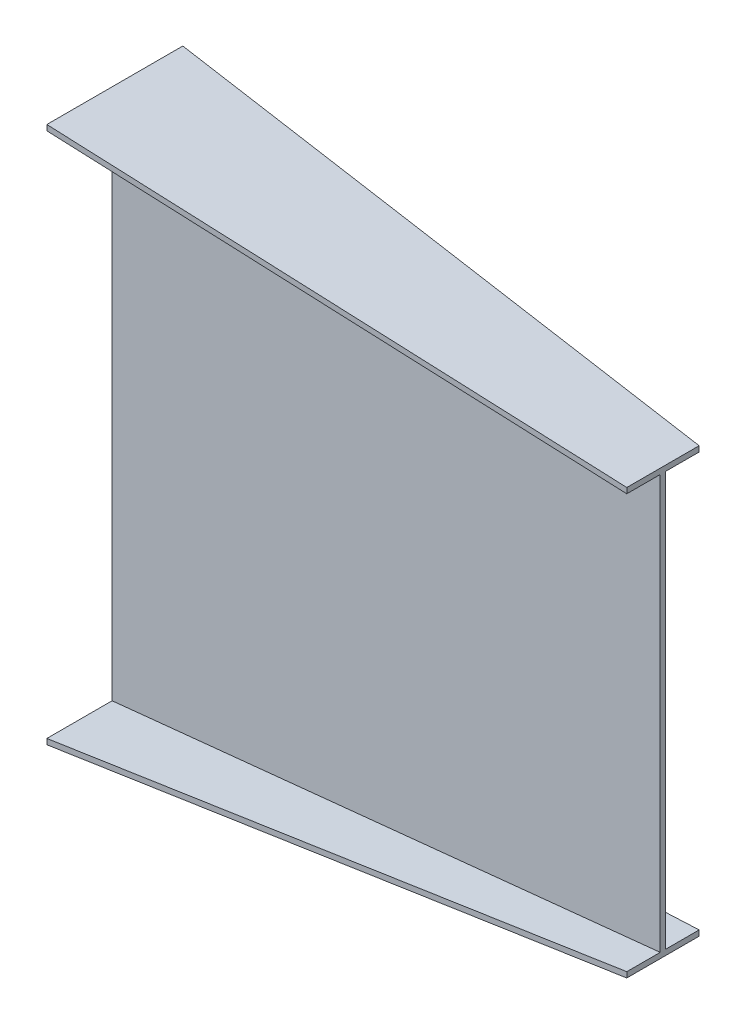
ISO-10303-21;
HEADER;
FILE_DESCRIPTION(('STEP AP214'),'2;1');
FILE_NAME('part.step','',(''),(''),'','','');
FILE_SCHEMA(('AUTOMOTIVE_DESIGN { 1 0 10303 214 1 1 1 1 }'));
ENDSEC;
DATA;
#1=APPLICATION_CONTEXT('core data for automotive mechanical design processes');
#2=APPLICATION_PROTOCOL_DEFINITION('international standard','automotive_design',2000,#1);
#3=PRODUCT_CONTEXT('',#1,'mechanical');
#4=PRODUCT('Part','Part','',(#3));
#5=PRODUCT_RELATED_PRODUCT_CATEGORY('part','',(#4));
#6=PRODUCT_DEFINITION_FORMATION('','',#4);
#7=PRODUCT_DEFINITION_CONTEXT('part definition',#1,'design');
#8=PRODUCT_DEFINITION('design','',#6,#7);
#9=PRODUCT_DEFINITION_SHAPE('','',#8);
#10=(LENGTH_UNIT() NAMED_UNIT(*) SI_UNIT(.MILLI.,.METRE.));
#11=(NAMED_UNIT(*) PLANE_ANGLE_UNIT() SI_UNIT($,.RADIAN.));
#12=(NAMED_UNIT(*) SI_UNIT($,.STERADIAN.) SOLID_ANGLE_UNIT());
#13=UNCERTAINTY_MEASURE_WITH_UNIT(LENGTH_MEASURE(1.E-05),#10,'distance_accuracy_value','');
#14=(GEOMETRIC_REPRESENTATION_CONTEXT(3) GLOBAL_UNCERTAINTY_ASSIGNED_CONTEXT((#13)) GLOBAL_UNIT_ASSIGNED_CONTEXT((#10,
#11,#12)) REPRESENTATION_CONTEXT('',''));
#15=CARTESIAN_POINT('',(0.,0.,0.));
#16=DIRECTION('',(0.,0.,1.));
#17=DIRECTION('',(1.,0.,0.));
#18=AXIS2_PLACEMENT_3D('',#15,#16,#17);
#19=CARTESIAN_POINT('',(1000.,0.,0.));
#20=DIRECTION('',(-1.,0.,0.));
#21=DIRECTION('',(0.,0.,1.));
#22=AXIS2_PLACEMENT_3D('',#19,#20,#21);
#23=PLANE('',#22);
#24=DIRECTION('',(0.,-1.,0.));
#25=VECTOR('',#24,1.);
#26=CARTESIAN_POINT('',(1000.,387.5,-60.9999999999997));
#27=LINE('',#26,#25);
#28=CARTESIAN_POINT('',(1000.,387.5,-60.9999999999997));
#29=VERTEX_POINT('',#28);
#30=CARTESIAN_POINT('',(1000.,377.5,-60.9999999999997));
#31=VERTEX_POINT('',#30);
#32=EDGE_CURVE('E377',#29,#31,#27,.T.);
#33=ORIENTED_EDGE('',*,*,#32,.F.);
#34=DIRECTION('',(0.,0.,-1.));
#35=VECTOR('',#34,1.);
#36=CARTESIAN_POINT('',(1000.,387.5,-60.9999999999997));
#37=LINE('',#36,#35);
#38=CARTESIAN_POINT('',(1000.,387.5,71.0000000000004));
#39=VERTEX_POINT('',#38);
#40=EDGE_CURVE('E12',#39,#29,#37,.T.);
#41=ORIENTED_EDGE('',*,*,#40,.F.);
#42=DIRECTION('',(0.,1.,0.));
#43=VECTOR('',#42,1.);
#44=CARTESIAN_POINT('',(1000.,387.5,71.0000000000004));
#45=LINE('',#44,#43);
#46=CARTESIAN_POINT('',(1000.,377.5,71.0000000000004));
#47=VERTEX_POINT('',#46);
#48=EDGE_CURVE('E71',#47,#39,#45,.T.);
#49=ORIENTED_EDGE('',*,*,#48,.F.);
#50=DIRECTION('',(0.,0.,1.));
#51=VECTOR('',#50,1.);
#52=CARTESIAN_POINT('',(1000.,377.5,10.0000000000002));
#53=LINE('',#52,#51);
#54=CARTESIAN_POINT('',(1000.,377.5,10.0000000000002));
#55=VERTEX_POINT('',#54);
#56=EDGE_CURVE('E652',#55,#47,#53,.T.);
#57=ORIENTED_EDGE('',*,*,#56,.F.);
#58=DIRECTION('',(0.,1.,0.));
#59=VECTOR('',#58,1.);
#60=CARTESIAN_POINT('',(1000.,377.5,10.0000000000002));
#61=LINE('',#60,#59);
#62=CARTESIAN_POINT('',(1000.,-377.5,10.0000000000002));
#63=VERTEX_POINT('',#62);
#64=EDGE_CURVE('E414',#63,#55,#61,.T.);
#65=ORIENTED_EDGE('',*,*,#64,.F.);
#66=DIRECTION('',(0.,0.,-1.));
#67=VECTOR('',#66,1.);
#68=CARTESIAN_POINT('',(1000.,-377.5,10.0000000000002));
#69=LINE('',#68,#67);
#70=CARTESIAN_POINT('',(1000.,-377.5,71.0000000000006));
#71=VERTEX_POINT('',#70);
#72=EDGE_CURVE('E428',#71,#63,#69,.T.);
#73=ORIENTED_EDGE('',*,*,#72,.F.);
#74=DIRECTION('',(0.,1.,0.));
#75=VECTOR('',#74,1.);
#76=CARTESIAN_POINT('',(1000.,-377.5,71.0000000000006));
#77=LINE('',#76,#75);
#78=CARTESIAN_POINT('',(1000.,-387.5,71.0000000000004));
#79=VERTEX_POINT('',#78);
#80=EDGE_CURVE('E442',#79,#71,#77,.T.);
#81=ORIENTED_EDGE('',*,*,#80,.F.);
#82=DIRECTION('',(0.,0.,1.));
#83=VECTOR('',#82,1.);
#84=CARTESIAN_POINT('',(1000.,-387.5,-60.9999999999997));
#85=LINE('',#84,#83);
#86=CARTESIAN_POINT('',(1000.,-387.5,-60.9999999999997));
#87=VERTEX_POINT('',#86);
#88=EDGE_CURVE('E623',#87,#79,#85,.T.);
#89=ORIENTED_EDGE('',*,*,#88,.F.);
#90=DIRECTION('',(0.,-1.,0.));
#91=VECTOR('',#90,1.);
#92=CARTESIAN_POINT('',(1000.,-377.5,-60.9999999999997));
#93=LINE('',#92,#91);
#94=CARTESIAN_POINT('',(1000.,-377.5,-60.9999999999997));
#95=VERTEX_POINT('',#94);
#96=EDGE_CURVE('E615',#95,#87,#93,.T.);
#97=ORIENTED_EDGE('',*,*,#96,.F.);
#98=DIRECTION('',(0.,0.,-1.));
#99=VECTOR('',#98,1.);
#100=CARTESIAN_POINT('',(1000.,-377.5,-60.9999999999997));
#101=LINE('',#100,#99);
#102=CARTESIAN_POINT('',(1000.,-377.5,2.22044604925031E-13));
#103=VERTEX_POINT('',#102);
#104=EDGE_CURVE('E530',#103,#95,#101,.T.);
#105=ORIENTED_EDGE('',*,*,#104,.F.);
#106=DIRECTION('',(0.,-1.,0.));
#107=VECTOR('',#106,1.);
#108=CARTESIAN_POINT('',(1000.,377.5,2.22044604925031E-13));
#109=LINE('',#108,#107);
#110=CARTESIAN_POINT('',(1000.,377.5,2.22044604925031E-13));
#111=VERTEX_POINT('',#110);
#112=EDGE_CURVE('E85',#111,#103,#109,.T.);
#113=ORIENTED_EDGE('',*,*,#112,.F.);
#114=DIRECTION('',(0.,0.,1.));
#115=VECTOR('',#114,1.);
#116=CARTESIAN_POINT('',(1000.,377.5,-60.9999999999997));
#117=LINE('',#116,#115);
#118=EDGE_CURVE('E79',#31,#111,#117,.T.);
#119=ORIENTED_EDGE('',*,*,#118,.F.);
#120=EDGE_LOOP('',(#33,#41,#49,#57,#65,#73,#81,#89,#97,#105,#113,#119));
#121=FACE_BOUND('',#120,.T.);
#122=ADVANCED_FACE('F61',(#121),#23,.F.);
#123=CARTESIAN_POINT('',(0.,0.,0.));
#124=DIRECTION('',(1.,0.,0.));
#125=DIRECTION('',(0.,0.,-1.));
#126=AXIS2_PLACEMENT_3D('',#123,#124,#125);
#127=PLANE('',#126);
#128=DIRECTION('',(0.,-1.,0.));
#129=VECTOR('',#128,1.);
#130=CARTESIAN_POINT('',(0.,490.,129.));
#131=LINE('',#130,#129);
#132=CARTESIAN_POINT('',(0.,490.,129.));
#133=VERTEX_POINT('',#132);
#134=CARTESIAN_POINT('',(0.,480.,129.));
#135=VERTEX_POINT('',#134);
#136=EDGE_CURVE('E160',#133,#135,#131,.T.);
#137=ORIENTED_EDGE('',*,*,#136,.F.);
#138=DIRECTION('',(0.,0.,1.));
#139=VECTOR('',#138,1.);
#140=CARTESIAN_POINT('',(0.,490.,129.));
#141=LINE('',#140,#139);
#142=CARTESIAN_POINT('',(0.,490.,-119.));
#143=VERTEX_POINT('',#142);
#144=EDGE_CURVE('E169',#143,#133,#141,.T.);
#145=ORIENTED_EDGE('',*,*,#144,.F.);
#146=DIRECTION('',(0.,1.,0.));
#147=VECTOR('',#146,1.);
#148=CARTESIAN_POINT('',(0.,490.,-119.));
#149=LINE('',#148,#147);
#150=CARTESIAN_POINT('',(0.,480.,-119.));
#151=VERTEX_POINT('',#150);
#152=EDGE_CURVE('E176',#151,#143,#149,.T.);
#153=ORIENTED_EDGE('',*,*,#152,.F.);
#154=DIRECTION('',(0.,0.,-1.));
#155=VECTOR('',#154,1.);
#156=CARTESIAN_POINT('',(0.,480.,4.49111529415288E-13));
#157=LINE('',#156,#155);
#158=CARTESIAN_POINT('',(0.,480.,4.49111529415288E-13));
#159=VERTEX_POINT('',#158);
#160=EDGE_CURVE('E300',#159,#151,#157,.T.);
#161=ORIENTED_EDGE('',*,*,#160,.F.);
#162=DIRECTION('',(0.,1.,0.));
#163=VECTOR('',#162,1.);
#164=CARTESIAN_POINT('',(0.,480.,4.49111529415288E-13));
#165=LINE('',#164,#163);
#166=CARTESIAN_POINT('',(0.,-480.,4.49111529415288E-13));
#167=VERTEX_POINT('',#166);
#168=EDGE_CURVE('E296',#167,#159,#165,.T.);
#169=ORIENTED_EDGE('',*,*,#168,.F.);
#170=DIRECTION('',(0.,0.,1.));
#171=VECTOR('',#170,1.);
#172=CARTESIAN_POINT('',(0.,-480.,4.49111529415288E-13));
#173=LINE('',#172,#171);
#174=CARTESIAN_POINT('',(0.,-480.,-119.));
#175=VERTEX_POINT('',#174);
#176=EDGE_CURVE('E292',#175,#167,#173,.T.);
#177=ORIENTED_EDGE('',*,*,#176,.F.);
#178=DIRECTION('',(0.,1.,0.));
#179=VECTOR('',#178,1.);
#180=CARTESIAN_POINT('',(0.,-480.,-119.));
#181=LINE('',#180,#179);
#182=CARTESIAN_POINT('',(0.,-490.,-119.));
#183=VERTEX_POINT('',#182);
#184=EDGE_CURVE('E288',#183,#175,#181,.T.);
#185=ORIENTED_EDGE('',*,*,#184,.F.);
#186=DIRECTION('',(0.,0.,-1.));
#187=VECTOR('',#186,1.);
#188=CARTESIAN_POINT('',(0.,-490.,129.));
#189=LINE('',#188,#187);
#190=CARTESIAN_POINT('',(0.,-490.,129.));
#191=VERTEX_POINT('',#190);
#192=EDGE_CURVE('E284',#191,#183,#189,.T.);
#193=ORIENTED_EDGE('',*,*,#192,.F.);
#194=DIRECTION('',(0.,-1.,0.));
#195=VECTOR('',#194,1.);
#196=CARTESIAN_POINT('',(0.,-480.,129.));
#197=LINE('',#196,#195);
#198=CARTESIAN_POINT('',(0.,-480.,129.));
#199=VERTEX_POINT('',#198);
#200=EDGE_CURVE('E280',#199,#191,#197,.T.);
#201=ORIENTED_EDGE('',*,*,#200,.F.);
#202=DIRECTION('',(0.,0.,1.));
#203=VECTOR('',#202,1.);
#204=CARTESIAN_POINT('',(0.,-480.,129.));
#205=LINE('',#204,#203);
#206=CARTESIAN_POINT('',(0.,-480.,10.0000000000005));
#207=VERTEX_POINT('',#206);
#208=EDGE_CURVE('E275',#207,#199,#205,.T.);
#209=ORIENTED_EDGE('',*,*,#208,.F.);
#210=DIRECTION('',(0.,-1.,0.));
#211=VECTOR('',#210,1.);
#212=CARTESIAN_POINT('',(0.,480.,10.0000000000005));
#213=LINE('',#212,#211);
#214=CARTESIAN_POINT('',(0.,480.,10.0000000000005));
#215=VERTEX_POINT('',#214);
#216=EDGE_CURVE('E273',#215,#207,#213,.T.);
#217=ORIENTED_EDGE('',*,*,#216,.F.);
#218=DIRECTION('',(0.,0.,-1.));
#219=VECTOR('',#218,1.);
#220=CARTESIAN_POINT('',(0.,480.,129.));
#221=LINE('',#220,#219);
#222=EDGE_CURVE('E182',#135,#215,#221,.T.);
#223=ORIENTED_EDGE('',*,*,#222,.F.);
#224=EDGE_LOOP('',(#137,#145,#153,#161,#169,#177,#185,#193,#201,#209,#217,#223));
#225=FACE_BOUND('',#224,.T.);
#226=ADVANCED_FACE('F180',(#225),#127,.F.);
#227=CARTESIAN_POINT('',(0.,0.,10.0000000000005));
#228=DIRECTION('',(0.,0.,1.));
#229=DIRECTION('',(1.,0.,0.));
#230=AXIS2_PLACEMENT_3D('',#227,#228,#229);
#231=PLANE('',#230);
#232=DIRECTION('',(0.994787908879574,0.101965760660156,0.));
#233=VECTOR('',#232,1.);
#234=CARTESIAN_POINT('',(0.,-480.,10.0000000000005));
#235=LINE('',#234,#233);
#236=EDGE_CURVE('E175',#207,#63,#235,.T.);
#237=ORIENTED_EDGE('',*,*,#236,.T.);
#238=ORIENTED_EDGE('',*,*,#64,.T.);
#239=DIRECTION('',(0.994787908879574,-0.101965760660156,0.));
#240=VECTOR('',#239,1.);
#241=CARTESIAN_POINT('',(0.,480.,10.0000000000005));
#242=LINE('',#241,#240);
#243=EDGE_CURVE('E387',#215,#55,#242,.T.);
#244=ORIENTED_EDGE('',*,*,#243,.F.);
#245=ORIENTED_EDGE('',*,*,#216,.T.);
#246=EDGE_LOOP('',(#237,#238,#244,#245));
#247=FACE_BOUND('',#246,.T.);
#248=ADVANCED_FACE('F203',(#247),#231,.T.);
#249=CARTESIAN_POINT('',(48.6884667957274,475.009432153438,0.));
#250=DIRECTION('',(-0.101965760660156,-0.994787908879574,0.));
#251=DIRECTION('',(0.994787908879574,-0.101965760660156,0.));
#252=AXIS2_PLACEMENT_3D('',#249,#250,#251);
#253=PLANE('',#252);
#254=ORIENTED_EDGE('',*,*,#243,.T.);
#255=ORIENTED_EDGE('',*,*,#56,.T.);
#256=DIRECTION('',(0.993136195055028,-0.10179645999314,-0.0576018993131917));
#257=VECTOR('',#256,1.);
#258=CARTESIAN_POINT('',(0.,480.,129.));
#259=LINE('',#258,#257);
#260=EDGE_CURVE('E165',#135,#47,#259,.T.);
#261=ORIENTED_EDGE('',*,*,#260,.F.);
#262=ORIENTED_EDGE('',*,*,#222,.T.);
#263=EDGE_LOOP('',(#254,#255,#261,#262));
#264=FACE_BOUND('',#263,.T.);
#265=ADVANCED_FACE('F389',(#264),#253,.T.);
#266=CARTESIAN_POINT('',(48.6884667957274,-475.009432153438,0.));
#267=DIRECTION('',(-0.101965760660156,0.994787908879574,0.));
#268=DIRECTION('',(-0.994787908879574,-0.101965760660156,0.));
#269=AXIS2_PLACEMENT_3D('',#266,#267,#268);
#270=PLANE('',#269);
#271=DIRECTION('',(0.993136195055028,0.10179645999314,-0.0576018993131912));
#272=VECTOR('',#271,1.);
#273=CARTESIAN_POINT('',(0.,-480.,129.));
#274=LINE('',#273,#272);
#275=EDGE_CURVE('E475',#199,#71,#274,.T.);
#276=ORIENTED_EDGE('',*,*,#275,.T.);
#277=ORIENTED_EDGE('',*,*,#72,.T.);
#278=ORIENTED_EDGE('',*,*,#236,.F.);
#279=ORIENTED_EDGE('',*,*,#208,.T.);
#280=EDGE_LOOP('',(#276,#277,#278,#279));
#281=FACE_BOUND('',#280,.T.);
#282=ADVANCED_FACE('F398',(#281),#270,.T.);
#283=CARTESIAN_POINT('',(7.45691493814897,-2.85477195069102E-12,128.567498933598));
#284=DIRECTION('',(0.0579026894458199,0.,0.998322231824445));
#285=DIRECTION('',(0.998322231824445,0.,-0.0579026894458199));
#286=AXIS2_PLACEMENT_3D('',#283,#284,#285);
#287=PLANE('',#286);
#288=DIRECTION('',(0.993136195055028,0.10179645999314,-0.0576018993131914));
#289=VECTOR('',#288,1.);
#290=CARTESIAN_POINT('',(0.,-490.,129.));
#291=LINE('',#290,#289);
#292=EDGE_CURVE('E467',#191,#79,#291,.T.);
#293=ORIENTED_EDGE('',*,*,#292,.T.);
#294=ORIENTED_EDGE('',*,*,#80,.T.);
#295=ORIENTED_EDGE('',*,*,#275,.F.);
#296=ORIENTED_EDGE('',*,*,#200,.T.);
#297=EDGE_LOOP('',(#293,#294,#295,#296));
#298=FACE_BOUND('',#297,.T.);
#299=ADVANCED_FACE('F448',(#298),#287,.T.);
#300=CARTESIAN_POINT('',(49.7028098539717,-484.905461989968,0.));
#301=DIRECTION('',(0.101965760660156,-0.994787908879574,0.));
#302=DIRECTION('',(0.994787908879574,0.101965760660156,0.));
#303=AXIS2_PLACEMENT_3D('',#300,#301,#302);
#304=PLANE('',#303);
#305=DIRECTION('',(0.993136195055028,0.10179645999314,0.0576018993131917));
#306=VECTOR('',#305,1.);
#307=CARTESIAN_POINT('',(0.,-490.,-119.));
#308=LINE('',#307,#306);
#309=EDGE_CURVE('E474',#183,#87,#308,.T.);
#310=ORIENTED_EDGE('',*,*,#309,.T.);
#311=ORIENTED_EDGE('',*,*,#88,.T.);
#312=ORIENTED_EDGE('',*,*,#292,.F.);
#313=ORIENTED_EDGE('',*,*,#192,.T.);
#314=EDGE_LOOP('',(#310,#311,#312,#313));
#315=FACE_BOUND('',#314,.T.);
#316=ADVANCED_FACE('F457',(#315),#304,.T.);
#317=CARTESIAN_POINT('',(6.87885951658621,0.,-118.601026148038));
#318=DIRECTION('',(0.0579026894458179,0.,-0.998322231824445));
#319=DIRECTION('',(-0.998322231824445,0.,-0.0579026894458179));
#320=AXIS2_PLACEMENT_3D('',#317,#318,#319);
#321=PLANE('',#320);
#322=DIRECTION('',(0.993136195055028,0.10179645999314,0.0576018993131917));
#323=VECTOR('',#322,1.);
#324=CARTESIAN_POINT('',(0.,-480.,-119.));
#325=LINE('',#324,#323);
#326=EDGE_CURVE('E492',#175,#95,#325,.T.);
#327=ORIENTED_EDGE('',*,*,#326,.T.);
#328=ORIENTED_EDGE('',*,*,#96,.T.);
#329=ORIENTED_EDGE('',*,*,#309,.F.);
#330=ORIENTED_EDGE('',*,*,#184,.T.);
#331=EDGE_LOOP('',(#327,#328,#329,#330));
#332=FACE_BOUND('',#331,.T.);
#333=ADVANCED_FACE('F503',(#332),#321,.T.);
#334=CARTESIAN_POINT('',(48.6884667957273,-475.009432153438,0.));
#335=DIRECTION('',(-0.101965760660156,0.994787908879574,0.));
#336=DIRECTION('',(-0.994787908879574,-0.101965760660156,0.));
#337=AXIS2_PLACEMENT_3D('',#334,#335,#336);
#338=PLANE('',#337);
#339=DIRECTION('',(0.994787908879574,0.101965760660156,0.));
#340=VECTOR('',#339,1.);
#341=CARTESIAN_POINT('',(0.,-480.,4.49111529415288E-13));
#342=LINE('',#341,#340);
#343=EDGE_CURVE('E569',#167,#103,#342,.T.);
#344=ORIENTED_EDGE('',*,*,#343,.T.);
#345=ORIENTED_EDGE('',*,*,#104,.T.);
#346=ORIENTED_EDGE('',*,*,#326,.F.);
#347=ORIENTED_EDGE('',*,*,#176,.T.);
#348=EDGE_LOOP('',(#344,#345,#346,#347));
#349=FACE_BOUND('',#348,.T.);
#350=ADVANCED_FACE('F512',(#349),#338,.T.);
#351=CARTESIAN_POINT('',(0.,0.,4.49111529415288E-13));
#352=DIRECTION('',(0.,0.,-1.));
#353=DIRECTION('',(-1.,0.,0.));
#354=AXIS2_PLACEMENT_3D('',#351,#352,#353);
#355=PLANE('',#354);
#356=DIRECTION('',(0.994787908879574,-0.101965760660156,0.));
#357=VECTOR('',#356,1.);
#358=CARTESIAN_POINT('',(0.,480.,4.49111529415288E-13));
#359=LINE('',#358,#357);
#360=EDGE_CURVE('E561',#159,#111,#359,.T.);
#361=ORIENTED_EDGE('',*,*,#360,.T.);
#362=ORIENTED_EDGE('',*,*,#112,.T.);
#363=ORIENTED_EDGE('',*,*,#343,.F.);
#364=ORIENTED_EDGE('',*,*,#168,.T.);
#365=EDGE_LOOP('',(#361,#362,#363,#364));
#366=FACE_BOUND('',#365,.T.);
#367=ADVANCED_FACE('F546',(#366),#355,.T.);
#368=CARTESIAN_POINT('',(48.6884667957274,475.009432153438,0.));
#369=DIRECTION('',(-0.101965760660156,-0.994787908879574,0.));
#370=DIRECTION('',(0.994787908879574,-0.101965760660156,0.));
#371=AXIS2_PLACEMENT_3D('',#368,#369,#370);
#372=PLANE('',#371);
#373=DIRECTION('',(0.993136195055028,-0.10179645999314,0.0576018993131914));
#374=VECTOR('',#373,1.);
#375=CARTESIAN_POINT('',(0.,480.,-119.));
#376=LINE('',#375,#374);
#377=EDGE_CURVE('E568',#151,#31,#376,.T.);
#378=ORIENTED_EDGE('',*,*,#377,.T.);
#379=ORIENTED_EDGE('',*,*,#118,.T.);
#380=ORIENTED_EDGE('',*,*,#360,.F.);
#381=ORIENTED_EDGE('',*,*,#160,.T.);
#382=EDGE_LOOP('',(#378,#379,#380,#381));
#383=FACE_BOUND('',#382,.T.);
#384=ADVANCED_FACE('F327',(#383),#372,.T.);
#385=CARTESIAN_POINT('',(6.87885951658616,0.,-118.601026148038));
#386=DIRECTION('',(0.0579026894458176,0.,-0.998322231824445));
#387=DIRECTION('',(-0.998322231824445,0.,-0.0579026894458176));
#388=AXIS2_PLACEMENT_3D('',#385,#386,#387);
#389=PLANE('',#388);
#390=DIRECTION('',(0.993136195055028,-0.10179645999314,0.0576018993131914));
#391=VECTOR('',#390,1.);
#392=CARTESIAN_POINT('',(0.,490.,-119.));
#393=LINE('',#392,#391);
#394=EDGE_CURVE('E166',#143,#29,#393,.T.);
#395=ORIENTED_EDGE('',*,*,#394,.T.);
#396=ORIENTED_EDGE('',*,*,#32,.T.);
#397=ORIENTED_EDGE('',*,*,#377,.F.);
#398=ORIENTED_EDGE('',*,*,#152,.T.);
#399=EDGE_LOOP('',(#395,#396,#397,#398));
#400=FACE_BOUND('',#399,.T.);
#401=ADVANCED_FACE('F317',(#400),#389,.T.);
#402=CARTESIAN_POINT('',(49.7028098539717,484.905461989968,0.));
#403=DIRECTION('',(0.101965760660156,0.994787908879574,0.));
#404=DIRECTION('',(-0.994787908879574,0.101965760660156,0.));
#405=AXIS2_PLACEMENT_3D('',#402,#403,#404);
#406=PLANE('',#405);
#407=DIRECTION('',(0.993136195055028,-0.10179645999314,-0.0576018993131917));
#408=VECTOR('',#407,1.);
#409=CARTESIAN_POINT('',(0.,490.,129.));
#410=LINE('',#409,#408);
#411=EDGE_CURVE('E155',#133,#39,#410,.T.);
#412=ORIENTED_EDGE('',*,*,#411,.T.);
#413=ORIENTED_EDGE('',*,*,#40,.T.);
#414=ORIENTED_EDGE('',*,*,#394,.F.);
#415=ORIENTED_EDGE('',*,*,#144,.T.);
#416=EDGE_LOOP('',(#412,#413,#414,#415));
#417=FACE_BOUND('',#416,.T.);
#418=ADVANCED_FACE('F171',(#417),#406,.T.);
#419=CARTESIAN_POINT('',(7.4569149381481,0.,128.567498933588));
#420=DIRECTION('',(0.0579026894458179,0.,0.998322231824445));
#421=DIRECTION('',(0.998322231824445,0.,-0.0579026894458179));
#422=AXIS2_PLACEMENT_3D('',#419,#420,#421);
#423=PLANE('',#422);
#424=ORIENTED_EDGE('',*,*,#260,.T.);
#425=ORIENTED_EDGE('',*,*,#48,.T.);
#426=ORIENTED_EDGE('',*,*,#411,.F.);
#427=ORIENTED_EDGE('',*,*,#136,.T.);
#428=EDGE_LOOP('',(#424,#425,#426,#427));
#429=FACE_BOUND('',#428,.T.);
#430=ADVANCED_FACE('F158',(#429),#423,.T.);
#431=CLOSED_SHELL('',(#122,#226,#248,#265,#282,#299,#316,#333,#350,#367,#384,#401,#418,#430));
#432=MANIFOLD_SOLID_BREP('B2',#431);
#433=ADVANCED_BREP_SHAPE_REPRESENTATION('',(#18,#432),#14);
#434=SHAPE_DEFINITION_REPRESENTATION(#9,#433);
ENDSEC;
END-ISO-10303-21;
